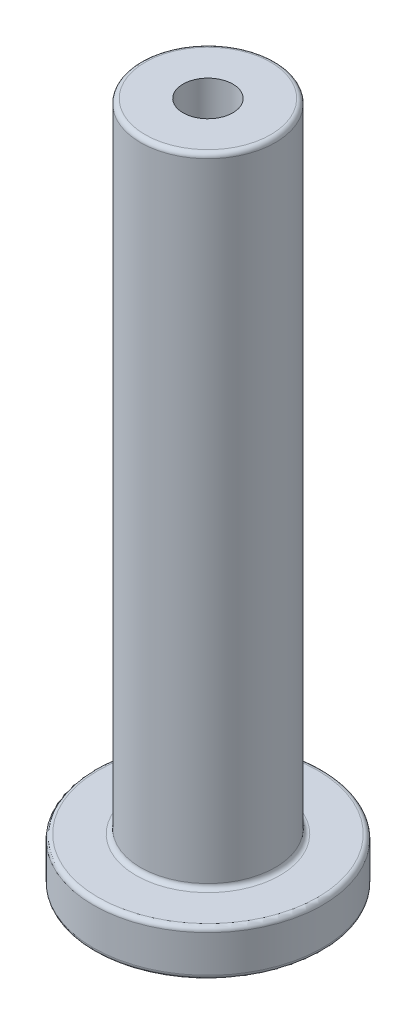
ISO-10303-21;
HEADER;
FILE_DESCRIPTION(('STEP AP214'),'2;1');
FILE_NAME('part.step','',(''),(''),'','','');
FILE_SCHEMA(('AUTOMOTIVE_DESIGN { 1 0 10303 214 1 1 1 1 }'));
ENDSEC;
DATA;
#1=APPLICATION_CONTEXT('core data for automotive mechanical design processes');
#2=APPLICATION_PROTOCOL_DEFINITION('international standard','automotive_design',2000,#1);
#3=PRODUCT_CONTEXT('',#1,'mechanical');
#4=PRODUCT('Part','Part','',(#3));
#5=PRODUCT_RELATED_PRODUCT_CATEGORY('part','',(#4));
#6=PRODUCT_DEFINITION_FORMATION('','',#4);
#7=PRODUCT_DEFINITION_CONTEXT('part definition',#1,'design');
#8=PRODUCT_DEFINITION('design','',#6,#7);
#9=PRODUCT_DEFINITION_SHAPE('','',#8);
#10=(LENGTH_UNIT() NAMED_UNIT(*) SI_UNIT(.MILLI.,.METRE.));
#11=(NAMED_UNIT(*) PLANE_ANGLE_UNIT() SI_UNIT($,.RADIAN.));
#12=(NAMED_UNIT(*) SI_UNIT($,.STERADIAN.) SOLID_ANGLE_UNIT());
#13=UNCERTAINTY_MEASURE_WITH_UNIT(LENGTH_MEASURE(1.E-05),#10,'distance_accuracy_value','');
#14=(GEOMETRIC_REPRESENTATION_CONTEXT(3) GLOBAL_UNCERTAINTY_ASSIGNED_CONTEXT((#13)) GLOBAL_UNIT_ASSIGNED_CONTEXT((#10,
#11,#12)) REPRESENTATION_CONTEXT('',''));
#15=CARTESIAN_POINT('',(0.,0.,0.));
#16=DIRECTION('',(0.,0.,1.));
#17=DIRECTION('',(1.,0.,0.));
#18=AXIS2_PLACEMENT_3D('',#15,#16,#17);
#19=CARTESIAN_POINT('',(0.,0.,0.));
#20=DIRECTION('',(0.,1.,0.));
#21=DIRECTION('',(0.,0.,1.));
#22=AXIS2_PLACEMENT_3D('',#19,#20,#21);
#23=CYLINDRICAL_SURFACE('',#22,2.7);
#24=CARTESIAN_POINT('',(0.,74.,0.));
#25=DIRECTION('',(0.,1.,0.));
#26=DIRECTION('',(0.,0.,1.));
#27=AXIS2_PLACEMENT_3D('',#24,#25,#26);
#28=CIRCLE('',#27,2.7);
#29=CARTESIAN_POINT('',(0.,74.,2.7));
#30=VERTEX_POINT('',#29);
#31=EDGE_CURVE('E143',#30,#30,#28,.T.);
#32=ORIENTED_EDGE('',*,*,#31,.T.);
#33=EDGE_LOOP('',(#32));
#34=FACE_BOUND('',#33,.T.);
#35=CARTESIAN_POINT('',(0.,3.,0.));
#36=DIRECTION('',(0.,-1.,0.));
#37=DIRECTION('',(0.,0.,-1.));
#38=AXIS2_PLACEMENT_3D('',#35,#36,#37);
#39=CIRCLE('',#38,2.7);
#40=CARTESIAN_POINT('',(0.,3.,-2.7));
#41=VERTEX_POINT('',#40);
#42=EDGE_CURVE('E137',#41,#41,#39,.F.);
#43=ORIENTED_EDGE('',*,*,#42,.F.);
#44=EDGE_LOOP('',(#43));
#45=FACE_BOUND('',#44,.T.);
#46=ADVANCED_FACE('F34',(#34,#45),#23,.F.);
#47=CARTESIAN_POINT('',(0.,5.,0.));
#48=DIRECTION('',(0.,-1.,0.));
#49=DIRECTION('',(0.,0.,-1.));
#50=AXIS2_PLACEMENT_3D('',#47,#48,#49);
#51=CYLINDRICAL_SURFACE('',#50,12.4);
#52=CARTESIAN_POINT('',(0.,0.5,0.));
#53=DIRECTION('',(0.,1.,0.));
#54=DIRECTION('',(0.,0.,1.));
#55=AXIS2_PLACEMENT_3D('',#52,#53,#54);
#56=CIRCLE('',#55,12.4);
#57=CARTESIAN_POINT('',(0.,0.5,12.4));
#58=VERTEX_POINT('',#57);
#59=EDGE_CURVE('E151',#58,#58,#56,.T.);
#60=ORIENTED_EDGE('',*,*,#59,.T.);
#61=EDGE_LOOP('',(#60));
#62=FACE_BOUND('',#61,.T.);
#63=CARTESIAN_POINT('',(0.,4.5,0.));
#64=DIRECTION('',(0.,1.,0.));
#65=DIRECTION('',(0.,0.,1.));
#66=AXIS2_PLACEMENT_3D('',#63,#64,#65);
#67=CIRCLE('',#66,12.4);
#68=CARTESIAN_POINT('',(0.,4.5,12.4));
#69=VERTEX_POINT('',#68);
#70=EDGE_CURVE('E146',#69,#69,#67,.F.);
#71=ORIENTED_EDGE('',*,*,#70,.T.);
#72=EDGE_LOOP('',(#71));
#73=FACE_BOUND('',#72,.T.);
#74=ADVANCED_FACE('F180',(#62,#73),#51,.T.);
#75=CARTESIAN_POINT('',(0.,5.,0.));
#76=DIRECTION('',(0.,1.,0.));
#77=DIRECTION('',(0.,0.,1.));
#78=AXIS2_PLACEMENT_3D('',#75,#76,#77);
#79=PLANE('',#78);
#80=CARTESIAN_POINT('',(0.,5.,0.));
#81=DIRECTION('',(0.,1.,0.));
#82=DIRECTION('',(0.,0.,1.));
#83=AXIS2_PLACEMENT_3D('',#80,#81,#82);
#84=CIRCLE('',#83,11.9);
#85=CARTESIAN_POINT('',(0.,5.,11.9));
#86=VERTEX_POINT('',#85);
#87=EDGE_CURVE('E160',#86,#86,#84,.T.);
#88=ORIENTED_EDGE('',*,*,#87,.T.);
#89=EDGE_LOOP('',(#88));
#90=FACE_BOUND('',#89,.T.);
#91=CARTESIAN_POINT('',(0.,5.,0.));
#92=DIRECTION('',(0.,1.,0.));
#93=DIRECTION('',(0.,0.,1.));
#94=AXIS2_PLACEMENT_3D('',#91,#92,#93);
#95=CIRCLE('',#94,7.8);
#96=CARTESIAN_POINT('',(0.,5.,7.8));
#97=VERTEX_POINT('',#96);
#98=EDGE_CURVE('E157',#97,#97,#95,.F.);
#99=ORIENTED_EDGE('',*,*,#98,.T.);
#100=EDGE_LOOP('',(#99));
#101=FACE_BOUND('',#100,.T.);
#102=ADVANCED_FACE('F186',(#90,#101),#79,.T.);
#103=CARTESIAN_POINT('',(0.,0.,0.));
#104=DIRECTION('',(0.,1.,0.));
#105=DIRECTION('',(0.,0.,1.));
#106=AXIS2_PLACEMENT_3D('',#103,#104,#105);
#107=PLANE('',#106);
#108=CARTESIAN_POINT('',(0.,0.,0.));
#109=DIRECTION('',(0.,1.,0.));
#110=DIRECTION('',(0.,0.,1.));
#111=AXIS2_PLACEMENT_3D('',#108,#109,#110);
#112=CIRCLE('',#111,11.9);
#113=CARTESIAN_POINT('',(0.,0.,11.9));
#114=VERTEX_POINT('',#113);
#115=EDGE_CURVE('E154',#114,#114,#112,.F.);
#116=ORIENTED_EDGE('',*,*,#115,.T.);
#117=EDGE_LOOP('',(#116));
#118=FACE_BOUND('',#117,.T.);
#119=DIRECTION('',(0.0798418692045175,0.,-0.996807542067138));
#120=VECTOR('',#119,1.);
#121=CARTESIAN_POINT('',(-4.38019792032887,0.,2.08179398086042));
#122=LINE('',#121,#120);
#123=CARTESIAN_POINT('',(-4.38019792032887,0.,2.08179398086042));
#124=VERTEX_POINT('',#123);
#125=CARTESIAN_POINT('',(-3.99298543303509,0.,-2.75246568217836));
#126=VERTEX_POINT('',#125);
#127=EDGE_CURVE('E124',#124,#126,#122,.T.);
#128=ORIENTED_EDGE('',*,*,#127,.F.);
#129=DIRECTION('',(-0.823339719511808,0.,-0.567548858050315));
#130=VECTOR('',#129,1.);
#131=CARTESIAN_POINT('',(-0.387212487293781,0.,4.83425966303878));
#132=LINE('',#131,#130);
#133=CARTESIAN_POINT('',(-0.387212487293781,0.,4.83425966303878));
#134=VERTEX_POINT('',#133);
#135=EDGE_CURVE('E49',#134,#124,#132,.T.);
#136=ORIENTED_EDGE('',*,*,#135,.F.);
#137=DIRECTION('',(-0.903181588716326,0.,0.429258684016822));
#138=VECTOR('',#137,1.);
#139=CARTESIAN_POINT('',(3.99298543303509,0.,2.75246568217836));
#140=LINE('',#139,#138);
#141=CARTESIAN_POINT('',(3.99298543303509,0.,2.75246568217836));
#142=VERTEX_POINT('',#141);
#143=EDGE_CURVE('E133',#142,#134,#140,.T.);
#144=ORIENTED_EDGE('',*,*,#143,.F.);
#145=DIRECTION('',(-0.0798418692045176,0.,0.996807542067138));
#146=VECTOR('',#145,1.);
#147=CARTESIAN_POINT('',(4.38019792032887,0.,-2.08179398086041));
#148=LINE('',#147,#146);
#149=CARTESIAN_POINT('',(4.38019792032887,0.,-2.08179398086041));
#150=VERTEX_POINT('',#149);
#151=EDGE_CURVE('E131',#150,#142,#148,.T.);
#152=ORIENTED_EDGE('',*,*,#151,.F.);
#153=DIRECTION('',(0.823339719511808,0.,0.567548858050315));
#154=VECTOR('',#153,1.);
#155=CARTESIAN_POINT('',(0.38721248729378,0.,-4.83425966303877));
#156=LINE('',#155,#154);
#157=CARTESIAN_POINT('',(0.38721248729378,0.,-4.83425966303877));
#158=VERTEX_POINT('',#157);
#159=EDGE_CURVE('E97',#158,#150,#156,.T.);
#160=ORIENTED_EDGE('',*,*,#159,.F.);
#161=DIRECTION('',(0.903181588716326,0.,-0.429258684016822));
#162=VECTOR('',#161,1.);
#163=CARTESIAN_POINT('',(-3.99298543303509,0.,-2.75246568217836));
#164=LINE('',#163,#162);
#165=EDGE_CURVE('E127',#126,#158,#164,.T.);
#166=ORIENTED_EDGE('',*,*,#165,.F.);
#167=EDGE_LOOP('',(#128,#136,#144,#152,#160,#166));
#168=FACE_BOUND('',#167,.T.);
#169=ADVANCED_FACE('F200',(#118,#168),#107,.F.);
#170=CARTESIAN_POINT('',(0.,74.,0.));
#171=DIRECTION('',(0.,-1.,0.));
#172=DIRECTION('',(0.,0.,-1.));
#173=AXIS2_PLACEMENT_3D('',#170,#171,#172);
#174=CYLINDRICAL_SURFACE('',#173,7.3);
#175=CARTESIAN_POINT('',(0.,73.5,0.));
#176=DIRECTION('',(0.,1.,0.));
#177=DIRECTION('',(0.,0.,1.));
#178=AXIS2_PLACEMENT_3D('',#175,#176,#177);
#179=CIRCLE('',#178,7.3);
#180=CARTESIAN_POINT('',(0.,73.5,7.3));
#181=VERTEX_POINT('',#180);
#182=EDGE_CURVE('E11',#181,#181,#179,.F.);
#183=ORIENTED_EDGE('',*,*,#182,.T.);
#184=EDGE_LOOP('',(#183));
#185=FACE_BOUND('',#184,.T.);
#186=CARTESIAN_POINT('',(0.,5.50000000000001,0.));
#187=DIRECTION('',(0.,1.,0.));
#188=DIRECTION('',(0.,0.,1.));
#189=AXIS2_PLACEMENT_3D('',#186,#187,#188);
#190=CIRCLE('',#189,7.3);
#191=CARTESIAN_POINT('',(0.,5.50000000000001,7.3));
#192=VERTEX_POINT('',#191);
#193=EDGE_CURVE('E42',#192,#192,#190,.T.);
#194=ORIENTED_EDGE('',*,*,#193,.T.);
#195=EDGE_LOOP('',(#194));
#196=FACE_BOUND('',#195,.T.);
#197=ADVANCED_FACE('F168',(#185,#196),#174,.T.);
#198=CARTESIAN_POINT('',(0.,74.,0.));
#199=DIRECTION('',(0.,1.,0.));
#200=DIRECTION('',(0.,0.,1.));
#201=AXIS2_PLACEMENT_3D('',#198,#199,#200);
#202=PLANE('',#201);
#203=CARTESIAN_POINT('',(0.,74.,0.));
#204=DIRECTION('',(0.,1.,0.));
#205=DIRECTION('',(0.,0.,1.));
#206=AXIS2_PLACEMENT_3D('',#203,#204,#205);
#207=CIRCLE('',#206,6.8);
#208=CARTESIAN_POINT('',(0.,74.,6.8));
#209=VERTEX_POINT('',#208);
#210=EDGE_CURVE('E163',#209,#209,#207,.T.);
#211=ORIENTED_EDGE('',*,*,#210,.T.);
#212=EDGE_LOOP('',(#211));
#213=FACE_BOUND('',#212,.T.);
#214=ORIENTED_EDGE('',*,*,#31,.F.);
#215=EDGE_LOOP('',(#214));
#216=FACE_BOUND('',#215,.T.);
#217=ADVANCED_FACE('F194',(#213,#216),#202,.T.);
#218=CARTESIAN_POINT('',(0.,3.,0.));
#219=DIRECTION('',(0.,-1.,0.));
#220=DIRECTION('',(0.,0.,-1.));
#221=AXIS2_PLACEMENT_3D('',#218,#219,#220);
#222=PLANE('',#221);
#223=DIRECTION('',(-0.823339719511808,0.,-0.567548858050315));
#224=VECTOR('',#223,1.);
#225=CARTESIAN_POINT('',(-0.387212487293781,3.,4.83425966303878));
#226=LINE('',#225,#224);
#227=CARTESIAN_POINT('',(-0.387212487293781,3.,4.83425966303878));
#228=VERTEX_POINT('',#227);
#229=CARTESIAN_POINT('',(-4.38019792032887,3.,2.08179398086042));
#230=VERTEX_POINT('',#229);
#231=EDGE_CURVE('E135',#228,#230,#226,.T.);
#232=ORIENTED_EDGE('',*,*,#231,.T.);
#233=DIRECTION('',(0.0798418692045175,0.,-0.996807542067138));
#234=VECTOR('',#233,1.);
#235=CARTESIAN_POINT('',(-4.38019792032887,3.,2.08179398086042));
#236=LINE('',#235,#234);
#237=CARTESIAN_POINT('',(-3.99298543303509,3.,-2.75246568217836));
#238=VERTEX_POINT('',#237);
#239=EDGE_CURVE('E118',#230,#238,#236,.T.);
#240=ORIENTED_EDGE('',*,*,#239,.T.);
#241=DIRECTION('',(0.903181588716326,0.,-0.429258684016822));
#242=VECTOR('',#241,1.);
#243=CARTESIAN_POINT('',(-3.99298543303509,3.,-2.75246568217836));
#244=LINE('',#243,#242);
#245=CARTESIAN_POINT('',(0.38721248729378,3.,-4.83425966303877));
#246=VERTEX_POINT('',#245);
#247=EDGE_CURVE('E116',#238,#246,#244,.T.);
#248=ORIENTED_EDGE('',*,*,#247,.T.);
#249=DIRECTION('',(0.823339719511808,0.,0.567548858050315));
#250=VECTOR('',#249,1.);
#251=CARTESIAN_POINT('',(0.38721248729378,3.,-4.83425966303877));
#252=LINE('',#251,#250);
#253=CARTESIAN_POINT('',(4.38019792032887,3.,-2.08179398086041));
#254=VERTEX_POINT('',#253);
#255=EDGE_CURVE('E94',#246,#254,#252,.T.);
#256=ORIENTED_EDGE('',*,*,#255,.T.);
#257=DIRECTION('',(-0.0798418692045176,0.,0.996807542067138));
#258=VECTOR('',#257,1.);
#259=CARTESIAN_POINT('',(4.38019792032887,3.,-2.08179398086041));
#260=LINE('',#259,#258);
#261=CARTESIAN_POINT('',(3.99298543303509,3.,2.75246568217836));
#262=VERTEX_POINT('',#261);
#263=EDGE_CURVE('E105',#254,#262,#260,.T.);
#264=ORIENTED_EDGE('',*,*,#263,.T.);
#265=DIRECTION('',(-0.903181588716326,0.,0.429258684016822));
#266=VECTOR('',#265,1.);
#267=CARTESIAN_POINT('',(3.99298543303509,3.,2.75246568217836));
#268=LINE('',#267,#266);
#269=EDGE_CURVE('E109',#262,#228,#268,.T.);
#270=ORIENTED_EDGE('',*,*,#269,.T.);
#271=EDGE_LOOP('',(#232,#240,#248,#256,#264,#270));
#272=FACE_BOUND('',#271,.T.);
#273=ORIENTED_EDGE('',*,*,#42,.T.);
#274=EDGE_LOOP('',(#273));
#275=FACE_BOUND('',#274,.T.);
#276=ADVANCED_FACE('F112',(#272,#275),#222,.T.);
#277=CARTESIAN_POINT('',(-0.387212487293781,3.,4.83425966303878));
#278=DIRECTION('',(-0.567548858050315,0.,0.823339719511808));
#279=DIRECTION('',(0.823339719511808,0.,0.567548858050315));
#280=AXIS2_PLACEMENT_3D('',#277,#278,#279);
#281=PLANE('',#280);
#282=ORIENTED_EDGE('',*,*,#135,.T.);
#283=DIRECTION('',(0.,-1.,0.));
#284=VECTOR('',#283,1.);
#285=CARTESIAN_POINT('',(-4.38019792032887,3.,2.08179398086042));
#286=LINE('',#285,#284);
#287=EDGE_CURVE('E79',#230,#124,#286,.T.);
#288=ORIENTED_EDGE('',*,*,#287,.F.);
#289=ORIENTED_EDGE('',*,*,#231,.F.);
#290=DIRECTION('',(0.,-1.,0.));
#291=VECTOR('',#290,1.);
#292=CARTESIAN_POINT('',(-0.387212487293781,3.,4.83425966303878));
#293=LINE('',#292,#291);
#294=EDGE_CURVE('E57',#228,#134,#293,.T.);
#295=ORIENTED_EDGE('',*,*,#294,.T.);
#296=EDGE_LOOP('',(#282,#288,#289,#295));
#297=FACE_BOUND('',#296,.T.);
#298=ADVANCED_FACE('F192',(#297),#281,.F.);
#299=CARTESIAN_POINT('',(3.99298543303509,3.,2.75246568217836));
#300=DIRECTION('',(0.429258684016822,0.,0.903181588716325));
#301=DIRECTION('',(0.903181588716326,0.,-0.429258684016822));
#302=AXIS2_PLACEMENT_3D('',#299,#300,#301);
#303=PLANE('',#302);
#304=ORIENTED_EDGE('',*,*,#143,.T.);
#305=ORIENTED_EDGE('',*,*,#294,.F.);
#306=ORIENTED_EDGE('',*,*,#269,.F.);
#307=DIRECTION('',(0.,-1.,0.));
#308=VECTOR('',#307,1.);
#309=CARTESIAN_POINT('',(3.99298543303509,3.,2.75246568217836));
#310=LINE('',#309,#308);
#311=EDGE_CURVE('E101',#262,#142,#310,.T.);
#312=ORIENTED_EDGE('',*,*,#311,.T.);
#313=EDGE_LOOP('',(#304,#305,#306,#312));
#314=FACE_BOUND('',#313,.T.);
#315=ADVANCED_FACE('F273',(#314),#303,.F.);
#316=CARTESIAN_POINT('',(4.38019792032887,3.,-2.08179398086041));
#317=DIRECTION('',(0.996807542067138,0.,0.0798418692045176));
#318=DIRECTION('',(0.0798418692045176,0.,-0.996807542067138));
#319=AXIS2_PLACEMENT_3D('',#316,#317,#318);
#320=PLANE('',#319);
#321=ORIENTED_EDGE('',*,*,#151,.T.);
#322=ORIENTED_EDGE('',*,*,#311,.F.);
#323=ORIENTED_EDGE('',*,*,#263,.F.);
#324=DIRECTION('',(0.,-1.,0.));
#325=VECTOR('',#324,1.);
#326=CARTESIAN_POINT('',(4.38019792032887,3.,-2.08179398086041));
#327=LINE('',#326,#325);
#328=EDGE_CURVE('E90',#254,#150,#327,.T.);
#329=ORIENTED_EDGE('',*,*,#328,.T.);
#330=EDGE_LOOP('',(#321,#322,#323,#329));
#331=FACE_BOUND('',#330,.T.);
#332=ADVANCED_FACE('F106',(#331),#320,.F.);
#333=CARTESIAN_POINT('',(0.38721248729378,3.,-4.83425966303877));
#334=DIRECTION('',(0.567548858050315,0.,-0.823339719511808));
#335=DIRECTION('',(-0.823339719511808,0.,-0.567548858050316));
#336=AXIS2_PLACEMENT_3D('',#333,#334,#335);
#337=PLANE('',#336);
#338=ORIENTED_EDGE('',*,*,#159,.T.);
#339=ORIENTED_EDGE('',*,*,#328,.F.);
#340=ORIENTED_EDGE('',*,*,#255,.F.);
#341=DIRECTION('',(0.,-1.,0.));
#342=VECTOR('',#341,1.);
#343=CARTESIAN_POINT('',(0.38721248729378,3.,-4.83425966303877));
#344=LINE('',#343,#342);
#345=EDGE_CURVE('E102',#246,#158,#344,.T.);
#346=ORIENTED_EDGE('',*,*,#345,.T.);
#347=EDGE_LOOP('',(#338,#339,#340,#346));
#348=FACE_BOUND('',#347,.T.);
#349=ADVANCED_FACE('F92',(#348),#337,.F.);
#350=CARTESIAN_POINT('',(-3.99298543303509,3.,-2.75246568217836));
#351=DIRECTION('',(-0.429258684016822,0.,-0.903181588716326));
#352=DIRECTION('',(-0.903181588716326,0.,0.429258684016822));
#353=AXIS2_PLACEMENT_3D('',#350,#351,#352);
#354=PLANE('',#353);
#355=ORIENTED_EDGE('',*,*,#165,.T.);
#356=ORIENTED_EDGE('',*,*,#345,.F.);
#357=ORIENTED_EDGE('',*,*,#247,.F.);
#358=DIRECTION('',(0.,-1.,0.));
#359=VECTOR('',#358,1.);
#360=CARTESIAN_POINT('',(-3.99298543303509,3.,-2.75246568217836));
#361=LINE('',#360,#359);
#362=EDGE_CURVE('E140',#238,#126,#361,.T.);
#363=ORIENTED_EDGE('',*,*,#362,.T.);
#364=EDGE_LOOP('',(#355,#356,#357,#363));
#365=FACE_BOUND('',#364,.T.);
#366=ADVANCED_FACE('F249',(#365),#354,.F.);
#367=CARTESIAN_POINT('',(-4.38019792032887,3.,2.08179398086042));
#368=DIRECTION('',(-0.996807542067138,0.,-0.0798418692045175));
#369=DIRECTION('',(-0.0798418692045175,0.,0.996807542067138));
#370=AXIS2_PLACEMENT_3D('',#367,#368,#369);
#371=PLANE('',#370);
#372=ORIENTED_EDGE('',*,*,#127,.T.);
#373=ORIENTED_EDGE('',*,*,#362,.F.);
#374=ORIENTED_EDGE('',*,*,#239,.F.);
#375=ORIENTED_EDGE('',*,*,#287,.T.);
#376=EDGE_LOOP('',(#372,#373,#374,#375));
#377=FACE_BOUND('',#376,.T.);
#378=ADVANCED_FACE('F211',(#377),#371,.F.);
#379=CARTESIAN_POINT('',(0.,0.5,0.));
#380=DIRECTION('',(0.,1.,0.));
#381=DIRECTION('',(0.,0.,1.));
#382=AXIS2_PLACEMENT_3D('',#379,#380,#381);
#383=TOROIDAL_SURFACE('',#382,11.9,0.5);
#384=ORIENTED_EDGE('',*,*,#115,.F.);
#385=EDGE_LOOP('',(#384));
#386=FACE_BOUND('',#385,.T.);
#387=ORIENTED_EDGE('',*,*,#59,.F.);
#388=EDGE_LOOP('',(#387));
#389=FACE_BOUND('',#388,.T.);
#390=ADVANCED_FACE('F208',(#386,#389),#383,.T.);
#391=CARTESIAN_POINT('',(0.,4.5,0.));
#392=DIRECTION('',(0.,1.,0.));
#393=DIRECTION('',(0.,0.,1.));
#394=AXIS2_PLACEMENT_3D('',#391,#392,#393);
#395=TOROIDAL_SURFACE('',#394,11.9,0.5);
#396=ORIENTED_EDGE('',*,*,#70,.F.);
#397=EDGE_LOOP('',(#396));
#398=FACE_BOUND('',#397,.T.);
#399=ORIENTED_EDGE('',*,*,#87,.F.);
#400=EDGE_LOOP('',(#399));
#401=FACE_BOUND('',#400,.T.);
#402=ADVANCED_FACE('F176',(#398,#401),#395,.T.);
#403=CARTESIAN_POINT('',(0.,73.5,0.));
#404=DIRECTION('',(0.,1.,0.));
#405=DIRECTION('',(0.,0.,1.));
#406=AXIS2_PLACEMENT_3D('',#403,#404,#405);
#407=TOROIDAL_SURFACE('',#406,6.8,0.5);
#408=ORIENTED_EDGE('',*,*,#182,.F.);
#409=EDGE_LOOP('',(#408));
#410=FACE_BOUND('',#409,.T.);
#411=ORIENTED_EDGE('',*,*,#210,.F.);
#412=EDGE_LOOP('',(#411));
#413=FACE_BOUND('',#412,.T.);
#414=ADVANCED_FACE('F171',(#410,#413),#407,.T.);
#415=CARTESIAN_POINT('',(0.,5.50000000000001,0.));
#416=DIRECTION('',(0.,1.,0.));
#417=DIRECTION('',(0.,0.,1.));
#418=AXIS2_PLACEMENT_3D('',#415,#416,#417);
#419=TOROIDAL_SURFACE('',#418,7.8,0.5);
#420=ORIENTED_EDGE('',*,*,#98,.F.);
#421=EDGE_LOOP('',(#420));
#422=FACE_BOUND('',#421,.T.);
#423=ORIENTED_EDGE('',*,*,#193,.F.);
#424=EDGE_LOOP('',(#423));
#425=FACE_BOUND('',#424,.T.);
#426=ADVANCED_FACE('F36',(#422,#425),#419,.F.);
#427=CLOSED_SHELL('',(#46,#74,#102,#169,#197,#217,#276,#298,#315,#332,#349,#366,#378,#390,#402,
#414,#426));
#428=MANIFOLD_SOLID_BREP('B2',#427);
#429=ADVANCED_BREP_SHAPE_REPRESENTATION('',(#18,#428),#14);
#430=SHAPE_DEFINITION_REPRESENTATION(#9,#429);
ENDSEC;
END-ISO-10303-21;
